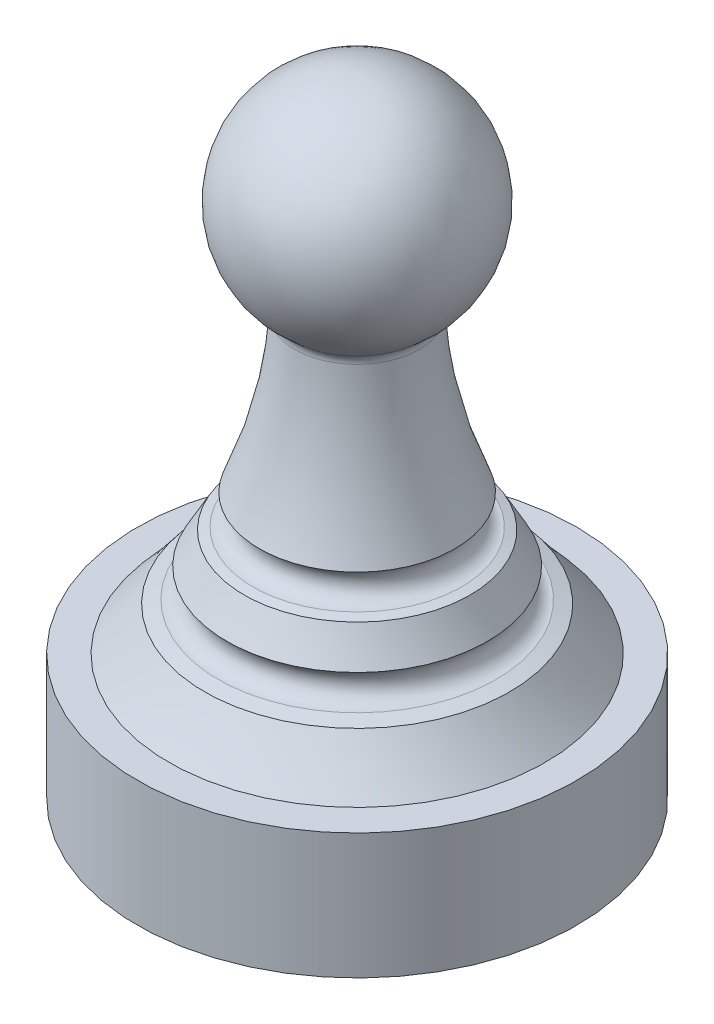
ISO-10303-21;
HEADER;
FILE_DESCRIPTION(('STEP AP214'),'2;1');
FILE_NAME('part.step','',(''),(''),'','','');
FILE_SCHEMA(('AUTOMOTIVE_DESIGN { 1 0 10303 214 1 1 1 1 }'));
ENDSEC;
DATA;
#1=APPLICATION_CONTEXT('core data for automotive mechanical design processes');
#2=APPLICATION_PROTOCOL_DEFINITION('international standard','automotive_design',2000,#1);
#3=PRODUCT_CONTEXT('',#1,'mechanical');
#4=PRODUCT('Part','Part','',(#3));
#5=PRODUCT_RELATED_PRODUCT_CATEGORY('part','',(#4));
#6=PRODUCT_DEFINITION_FORMATION('','',#4);
#7=PRODUCT_DEFINITION_CONTEXT('part definition',#1,'design');
#8=PRODUCT_DEFINITION('design','',#6,#7);
#9=PRODUCT_DEFINITION_SHAPE('','',#8);
#10=(LENGTH_UNIT() NAMED_UNIT(*) SI_UNIT(.MILLI.,.METRE.));
#11=(NAMED_UNIT(*) PLANE_ANGLE_UNIT() SI_UNIT($,.RADIAN.));
#12=(NAMED_UNIT(*) SI_UNIT($,.STERADIAN.) SOLID_ANGLE_UNIT());
#13=UNCERTAINTY_MEASURE_WITH_UNIT(LENGTH_MEASURE(1.E-05),#10,'distance_accuracy_value','');
#14=(GEOMETRIC_REPRESENTATION_CONTEXT(3) GLOBAL_UNCERTAINTY_ASSIGNED_CONTEXT((#13)) GLOBAL_UNIT_ASSIGNED_CONTEXT((#10,
#11,#12)) REPRESENTATION_CONTEXT('',''));
#15=CARTESIAN_POINT('',(0.,0.,0.));
#16=DIRECTION('',(0.,0.,1.));
#17=DIRECTION('',(1.,0.,0.));
#18=AXIS2_PLACEMENT_3D('',#15,#16,#17);
#19=CARTESIAN_POINT('',(0.,14.5,0.));
#20=DIRECTION('',(0.,-1.,0.));
#21=DIRECTION('',(-1.,0.,0.));
#22=AXIS2_PLACEMENT_3D('',#19,#20,#21);
#23=SPHERICAL_SURFACE('',#22,3.5);
#24=CARTESIAN_POINT('',(0.,11.7287752969879,0.));
#25=DIRECTION('',(0.,-1.,0.));
#26=DIRECTION('',(0.,0.,-1.));
#27=AXIS2_PLACEMENT_3D('',#24,#25,#26);
#28=CIRCLE('',#27,2.13782918995311);
#29=CARTESIAN_POINT('',(0.,11.7287752969879,-2.13782918995311));
#30=VERTEX_POINT('',#29);
#31=EDGE_CURVE('E10',#30,#30,#28,.T.);
#32=ORIENTED_EDGE('',*,*,#31,.F.);
#33=EDGE_LOOP('',(#32));
#34=FACE_BOUND('',#33,.T.);
#35=ADVANCED_FACE('F31',(#34),#23,.T.);
#36=CARTESIAN_POINT('',(0.,11.412063902358,0.));
#37=DIRECTION('',(0.,-1.,0.));
#38=DIRECTION('',(0.,0.,-1.));
#39=AXIS2_PLACEMENT_3D('',#36,#37,#38);
#40=TOROIDAL_SURFACE('',#39,2.38215252594775,0.400000000000001);
#41=CARTESIAN_POINT('',(0.,11.3893092119045,0.));
#42=DIRECTION('',(0.,-1.,0.));
#43=DIRECTION('',(0.,0.,-1.));
#44=AXIS2_PLACEMENT_3D('',#41,#42,#43);
#45=CIRCLE('',#44,1.98280027033578);
#46=CARTESIAN_POINT('',(0.,11.3893092119045,-1.98280027033578));
#47=VERTEX_POINT('',#46);
#48=EDGE_CURVE('E37',#47,#47,#45,.T.);
#49=ORIENTED_EDGE('',*,*,#48,.F.);
#50=EDGE_LOOP('',(#49));
#51=FACE_BOUND('',#50,.T.);
#52=ORIENTED_EDGE('',*,*,#31,.T.);
#53=EDGE_LOOP('',(#52));
#54=FACE_BOUND('',#53,.T.);
#55=ADVANCED_FACE('F110',(#51,#54),#40,.F.);
#56=CARTESIAN_POINT('',(0.,12.2426101039076,0.));
#57=DIRECTION('',(0.,-1.,0.));
#58=DIRECTION('',(0.,0.,-1.));
#59=AXIS2_PLACEMENT_3D('',#56,#57,#58);
#60=TOROIDAL_SURFACE('',#59,16.9585098557847,15.);
#61=CARTESIAN_POINT('',(0.,6.45804746335017,0.));
#62=DIRECTION('',(0.,-1.,0.));
#63=DIRECTION('',(0.,0.,-1.));
#64=AXIS2_PLACEMENT_3D('',#61,#62,#63);
#65=CIRCLE('',#64,3.11875425615551);
#66=CARTESIAN_POINT('',(0.,6.45804746335017,-3.11875425615551));
#67=VERTEX_POINT('',#66);
#68=EDGE_CURVE('E41',#67,#67,#65,.T.);
#69=ORIENTED_EDGE('',*,*,#68,.F.);
#70=EDGE_LOOP('',(#69));
#71=FACE_BOUND('',#70,.T.);
#72=ORIENTED_EDGE('',*,*,#48,.T.);
#73=EDGE_LOOP('',(#72));
#74=FACE_BOUND('',#73,.T.);
#75=ADVANCED_FACE('F115',(#71,#74),#60,.F.);
#76=CARTESIAN_POINT('',(0.,6.,0.));
#77=DIRECTION('',(0.,-1.,0.));
#78=DIRECTION('',(0.,0.,-1.));
#79=AXIS2_PLACEMENT_3D('',#76,#77,#78);
#80=TOROIDAL_SURFACE('',#79,3.31923498170907,0.5);
#81=CARTESIAN_POINT('',(0.,5.5,0.));
#82=DIRECTION('',(0.,-1.,0.));
#83=DIRECTION('',(0.,0.,-1.));
#84=AXIS2_PLACEMENT_3D('',#81,#82,#83);
#85=CIRCLE('',#84,3.31923498170907);
#86=CARTESIAN_POINT('',(0.,5.5,-3.31923498170907));
#87=VERTEX_POINT('',#86);
#88=EDGE_CURVE('E45',#87,#87,#85,.T.);
#89=ORIENTED_EDGE('',*,*,#88,.F.);
#90=EDGE_LOOP('',(#89));
#91=FACE_BOUND('',#90,.T.);
#92=ORIENTED_EDGE('',*,*,#68,.T.);
#93=EDGE_LOOP('',(#92));
#94=FACE_BOUND('',#93,.T.);
#95=ADVANCED_FACE('F120',(#91,#94),#80,.F.);
#96=CARTESIAN_POINT('',(0.,5.5,0.));
#97=DIRECTION('',(0.,-1.,0.));
#98=DIRECTION('',(0.,0.,-1.));
#99=AXIS2_PLACEMENT_3D('',#96,#97,#98);
#100=CONICAL_SURFACE('',#99,3.31923498170907,1.2915436464758);
#101=CARTESIAN_POINT('',(0.,5.41943248418015,0.));
#102=DIRECTION('',(0.,-1.,0.));
#103=DIRECTION('',(0.,0.,-1.));
#104=AXIS2_PLACEMENT_3D('',#101,#102,#103);
#105=CIRCLE('',#104,3.6002073000836);
#106=CARTESIAN_POINT('',(0.,5.41943248418015,-3.6002073000836));
#107=VERTEX_POINT('',#106);
#108=EDGE_CURVE('E50',#107,#107,#105,.T.);
#109=ORIENTED_EDGE('',*,*,#108,.F.);
#110=EDGE_LOOP('',(#109));
#111=FACE_BOUND('',#110,.T.);
#112=ORIENTED_EDGE('',*,*,#88,.T.);
#113=EDGE_LOOP('',(#112));
#114=FACE_BOUND('',#113,.T.);
#115=ADVANCED_FACE('F126',(#111,#114),#100,.T.);
#116=CARTESIAN_POINT('',(0.,12.2426101039076,0.));
#117=DIRECTION('',(0.,-1.,0.));
#118=DIRECTION('',(0.,0.,-1.));
#119=AXIS2_PLACEMENT_3D('',#116,#117,#118);
#120=TOROIDAL_SURFACE('',#119,16.9585098557847,15.);
#121=CARTESIAN_POINT('',(0.,4.42226564805178,0.));
#122=DIRECTION('',(0.,-1.,0.));
#123=DIRECTION('',(0.,0.,-1.));
#124=AXIS2_PLACEMENT_3D('',#121,#122,#123);
#125=CIRCLE('',#124,4.15842342671066);
#126=CARTESIAN_POINT('',(0.,4.42226564805178,-4.15842342671066));
#127=VERTEX_POINT('',#126);
#128=EDGE_CURVE('E53',#127,#127,#125,.T.);
#129=ORIENTED_EDGE('',*,*,#128,.F.);
#130=EDGE_LOOP('',(#129));
#131=FACE_BOUND('',#130,.T.);
#132=ORIENTED_EDGE('',*,*,#108,.T.);
#133=EDGE_LOOP('',(#132));
#134=FACE_BOUND('',#133,.T.);
#135=ADVANCED_FACE('F130',(#131,#134),#120,.F.);
#136=CARTESIAN_POINT('',(0.,4.,0.));
#137=DIRECTION('',(0.,-1.,0.));
#138=DIRECTION('',(0.,0.,-1.));
#139=AXIS2_PLACEMENT_3D('',#136,#137,#138);
#140=TOROIDAL_SURFACE('',#139,4.42617652655344,0.5);
#141=CARTESIAN_POINT('',(0.,3.5,0.));
#142=DIRECTION('',(0.,-1.,0.));
#143=DIRECTION('',(0.,0.,-1.));
#144=AXIS2_PLACEMENT_3D('',#141,#142,#143);
#145=CIRCLE('',#144,4.42617652655344);
#146=CARTESIAN_POINT('',(0.,3.5,-4.42617652655344));
#147=VERTEX_POINT('',#146);
#148=EDGE_CURVE('E56',#147,#147,#145,.T.);
#149=ORIENTED_EDGE('',*,*,#148,.F.);
#150=EDGE_LOOP('',(#149));
#151=FACE_BOUND('',#150,.T.);
#152=ORIENTED_EDGE('',*,*,#128,.T.);
#153=EDGE_LOOP('',(#152));
#154=FACE_BOUND('',#153,.T.);
#155=ADVANCED_FACE('F134',(#151,#154),#140,.F.);
#156=CARTESIAN_POINT('',(0.,3.5,0.));
#157=DIRECTION('',(0.,-1.,0.));
#158=DIRECTION('',(0.,0.,-1.));
#159=AXIS2_PLACEMENT_3D('',#156,#157,#158);
#160=CONICAL_SURFACE('',#159,4.42617652655344,1.2915436464758);
#161=CARTESIAN_POINT('',(0.,3.37563682489352,0.));
#162=DIRECTION('',(0.,-1.,0.));
#163=DIRECTION('',(0.,0.,-1.));
#164=AXIS2_PLACEMENT_3D('',#161,#162,#163);
#165=CIRCLE('',#164,4.85988245970167);
#166=CARTESIAN_POINT('',(0.,3.37563682489352,-4.85988245970167));
#167=VERTEX_POINT('',#166);
#168=EDGE_CURVE('E59',#167,#167,#165,.T.);
#169=ORIENTED_EDGE('',*,*,#168,.F.);
#170=EDGE_LOOP('',(#169));
#171=FACE_BOUND('',#170,.T.);
#172=ORIENTED_EDGE('',*,*,#148,.T.);
#173=EDGE_LOOP('',(#172));
#174=FACE_BOUND('',#173,.T.);
#175=ADVANCED_FACE('F106',(#171,#174),#160,.T.);
#176=CARTESIAN_POINT('',(0.,12.2426101039076,0.));
#177=DIRECTION('',(0.,-1.,0.));
#178=DIRECTION('',(0.,0.,-1.));
#179=AXIS2_PLACEMENT_3D('',#176,#177,#178);
#180=TOROIDAL_SURFACE('',#179,16.9585098557847,15.);
#181=CARTESIAN_POINT('',(0.,1.99999999999999,0.));
#182=DIRECTION('',(0.,-1.,0.));
#183=DIRECTION('',(0.,0.,-1.));
#184=AXIS2_PLACEMENT_3D('',#181,#182,#183);
#185=CIRCLE('',#184,6.00000000000001);
#186=CARTESIAN_POINT('',(0.,1.99999999999999,-6.00000000000001));
#187=VERTEX_POINT('',#186);
#188=EDGE_CURVE('E62',#187,#187,#185,.T.);
#189=ORIENTED_EDGE('',*,*,#188,.F.);
#190=EDGE_LOOP('',(#189));
#191=FACE_BOUND('',#190,.T.);
#192=ORIENTED_EDGE('',*,*,#168,.T.);
#193=EDGE_LOOP('',(#192));
#194=FACE_BOUND('',#193,.T.);
#195=ADVANCED_FACE('F100',(#191,#194),#180,.F.);
#196=CARTESIAN_POINT('',(0.,2.,0.));
#197=DIRECTION('',(0.,-1.,0.));
#198=DIRECTION('',(0.,0.,-1.));
#199=AXIS2_PLACEMENT_3D('',#196,#197,#198);
#200=PLANE('',#199);
#201=ORIENTED_EDGE('',*,*,#188,.T.);
#202=EDGE_LOOP('',(#201));
#203=FACE_BOUND('',#202,.T.);
#204=CARTESIAN_POINT('',(0.,2.,0.));
#205=DIRECTION('',(0.,-1.,0.));
#206=DIRECTION('',(0.,0.,-1.));
#207=AXIS2_PLACEMENT_3D('',#204,#205,#206);
#208=CIRCLE('',#207,7.);
#209=CARTESIAN_POINT('',(0.,2.,-7.));
#210=VERTEX_POINT('',#209);
#211=EDGE_CURVE('E68',#210,#210,#208,.T.);
#212=ORIENTED_EDGE('',*,*,#211,.F.);
#213=EDGE_LOOP('',(#212));
#214=FACE_BOUND('',#213,.T.);
#215=ADVANCED_FACE('F90',(#203,#214),#200,.F.);
#216=CARTESIAN_POINT('',(0.,-2.,0.));
#217=DIRECTION('',(0.,-1.,0.));
#218=DIRECTION('',(0.,0.,-1.));
#219=AXIS2_PLACEMENT_3D('',#216,#217,#218);
#220=PLANE('',#219);
#221=CARTESIAN_POINT('',(0.,-2.,0.));
#222=DIRECTION('',(0.,-1.,0.));
#223=DIRECTION('',(0.,0.,-1.));
#224=AXIS2_PLACEMENT_3D('',#221,#222,#223);
#225=CIRCLE('',#224,6.05);
#226=CARTESIAN_POINT('',(0.,-2.,-6.05));
#227=VERTEX_POINT('',#226);
#228=EDGE_CURVE('E72',#227,#227,#225,.T.);
#229=ORIENTED_EDGE('',*,*,#228,.F.);
#230=EDGE_LOOP('',(#229));
#231=FACE_BOUND('',#230,.T.);
#232=CARTESIAN_POINT('',(0.,-2.,0.));
#233=DIRECTION('',(0.,-1.,0.));
#234=DIRECTION('',(0.,0.,-1.));
#235=AXIS2_PLACEMENT_3D('',#232,#233,#234);
#236=CIRCLE('',#235,7.);
#237=CARTESIAN_POINT('',(0.,-2.,-7.));
#238=VERTEX_POINT('',#237);
#239=EDGE_CURVE('E65',#238,#238,#236,.T.);
#240=ORIENTED_EDGE('',*,*,#239,.T.);
#241=EDGE_LOOP('',(#240));
#242=FACE_BOUND('',#241,.T.);
#243=ADVANCED_FACE('F87',(#231,#242),#220,.T.);
#244=CARTESIAN_POINT('',(0.,-2.,0.));
#245=DIRECTION('',(0.,1.,0.));
#246=DIRECTION('',(0.,0.,1.));
#247=AXIS2_PLACEMENT_3D('',#244,#245,#246);
#248=CYLINDRICAL_SURFACE('',#247,7.);
#249=ORIENTED_EDGE('',*,*,#239,.F.);
#250=EDGE_LOOP('',(#249));
#251=FACE_BOUND('',#250,.T.);
#252=ORIENTED_EDGE('',*,*,#211,.T.);
#253=EDGE_LOOP('',(#252));
#254=FACE_BOUND('',#253,.T.);
#255=ADVANCED_FACE('F83',(#251,#254),#248,.T.);
#256=CARTESIAN_POINT('',(0.,1.2,0.));
#257=DIRECTION('',(0.,-1.,0.));
#258=DIRECTION('',(0.,0.,-1.));
#259=AXIS2_PLACEMENT_3D('',#256,#257,#258);
#260=CYLINDRICAL_SURFACE('',#259,6.05);
#261=CARTESIAN_POINT('',(0.,1.2,0.));
#262=DIRECTION('',(0.,-1.,0.));
#263=DIRECTION('',(0.,0.,-1.));
#264=AXIS2_PLACEMENT_3D('',#261,#262,#263);
#265=CIRCLE('',#264,6.05);
#266=CARTESIAN_POINT('',(0.,1.2,-6.05));
#267=VERTEX_POINT('',#266);
#268=EDGE_CURVE('E71',#267,#267,#265,.T.);
#269=ORIENTED_EDGE('',*,*,#268,.F.);
#270=EDGE_LOOP('',(#269));
#271=FACE_BOUND('',#270,.T.);
#272=ORIENTED_EDGE('',*,*,#228,.T.);
#273=EDGE_LOOP('',(#272));
#274=FACE_BOUND('',#273,.T.);
#275=ADVANCED_FACE('F80',(#271,#274),#260,.F.);
#276=CARTESIAN_POINT('',(0.,1.2,0.));
#277=DIRECTION('',(0.,-1.,0.));
#278=DIRECTION('',(0.,0.,-1.));
#279=AXIS2_PLACEMENT_3D('',#276,#277,#278);
#280=PLANE('',#279);
#281=ORIENTED_EDGE('',*,*,#268,.T.);
#282=EDGE_LOOP('',(#281));
#283=FACE_BOUND('',#282,.T.);
#284=ADVANCED_FACE('F78',(#283),#280,.T.);
#285=CLOSED_SHELL('',(#35,#55,#75,#95,#115,#135,#155,#175,#195,#215,#243,#255,#275,#284));
#286=MANIFOLD_SOLID_BREP('B2',#285);
#287=ADVANCED_BREP_SHAPE_REPRESENTATION('',(#18,#286),#14);
#288=SHAPE_DEFINITION_REPRESENTATION(#9,#287);
ENDSEC;
END-ISO-10303-21;
